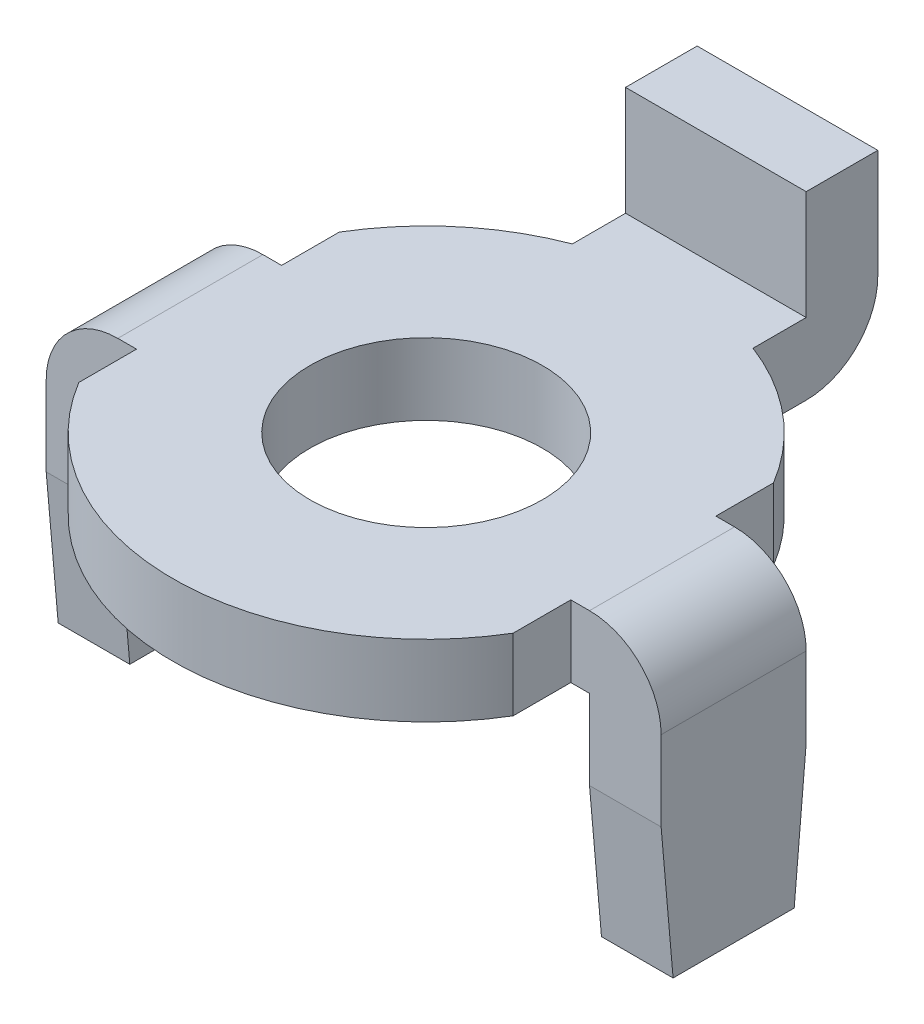
ISO-10303-21;
HEADER;
FILE_DESCRIPTION(('STEP AP214'),'2;1');
FILE_NAME('part.step','',(''),(''),'','','');
FILE_SCHEMA(('AUTOMOTIVE_DESIGN { 1 0 10303 214 1 1 1 1 }'));
ENDSEC;
DATA;
#1=APPLICATION_CONTEXT('core data for automotive mechanical design processes');
#2=APPLICATION_PROTOCOL_DEFINITION('international standard','automotive_design',2000,#1);
#3=PRODUCT_CONTEXT('',#1,'mechanical');
#4=PRODUCT('Part','Part','',(#3));
#5=PRODUCT_RELATED_PRODUCT_CATEGORY('part','',(#4));
#6=PRODUCT_DEFINITION_FORMATION('','',#4);
#7=PRODUCT_DEFINITION_CONTEXT('part definition',#1,'design');
#8=PRODUCT_DEFINITION('design','',#6,#7);
#9=PRODUCT_DEFINITION_SHAPE('','',#8);
#10=(LENGTH_UNIT() NAMED_UNIT(*) SI_UNIT(.MILLI.,.METRE.));
#11=(NAMED_UNIT(*) PLANE_ANGLE_UNIT() SI_UNIT($,.RADIAN.));
#12=(NAMED_UNIT(*) SI_UNIT($,.STERADIAN.) SOLID_ANGLE_UNIT());
#13=UNCERTAINTY_MEASURE_WITH_UNIT(LENGTH_MEASURE(1.E-05),#10,'distance_accuracy_value','');
#14=(GEOMETRIC_REPRESENTATION_CONTEXT(3) GLOBAL_UNCERTAINTY_ASSIGNED_CONTEXT((#13)) GLOBAL_UNIT_ASSIGNED_CONTEXT((#10,
#11,#12)) REPRESENTATION_CONTEXT('',''));
#15=CARTESIAN_POINT('',(0.,0.,0.));
#16=DIRECTION('',(0.,0.,1.));
#17=DIRECTION('',(1.,0.,0.));
#18=AXIS2_PLACEMENT_3D('',#15,#16,#17);
#19=CARTESIAN_POINT('',(0.,0.,0.));
#20=DIRECTION('',(0.,1.,0.));
#21=DIRECTION('',(0.,0.,1.));
#22=AXIS2_PLACEMENT_3D('',#19,#20,#21);
#23=PLANE('',#22);
#24=CARTESIAN_POINT('',(0.,0.,0.));
#25=DIRECTION('',(0.,1.,0.));
#26=DIRECTION('',(0.,0.,1.));
#27=AXIS2_PLACEMENT_3D('',#24,#25,#26);
#28=CIRCLE('',#27,2.55);
#29=CARTESIAN_POINT('',(0.,0.,2.55));
#30=VERTEX_POINT('',#29);
#31=EDGE_CURVE('E554',#30,#30,#28,.T.);
#32=ORIENTED_EDGE('',*,*,#31,.T.);
#33=EDGE_LOOP('',(#32));
#34=FACE_BOUND('',#33,.T.);
#35=DIRECTION('',(0.,0.,1.));
#36=VECTOR('',#35,1.);
#37=CARTESIAN_POINT('',(-1.98,0.,-7.92));
#38=LINE('',#37,#36);
#39=CARTESIAN_POINT('',(-1.98,0.,-6.35));
#40=VERTEX_POINT('',#39);
#41=CARTESIAN_POINT('',(-1.98,0.,-5.18479507791774));
#42=VERTEX_POINT('',#41);
#43=EDGE_CURVE('E433',#40,#42,#38,.T.);
#44=ORIENTED_EDGE('',*,*,#43,.F.);
#45=DIRECTION('',(-1.,0.,0.));
#46=VECTOR('',#45,1.);
#47=CARTESIAN_POINT('',(0.,0.,-6.35));
#48=LINE('',#47,#46);
#49=CARTESIAN_POINT('',(1.98,0.,-6.35));
#50=VERTEX_POINT('',#49);
#51=EDGE_CURVE('E310',#40,#50,#48,.F.);
#52=ORIENTED_EDGE('',*,*,#51,.T.);
#53=DIRECTION('',(0.,0.,-1.));
#54=VECTOR('',#53,1.);
#55=CARTESIAN_POINT('',(1.98,0.,-7.92));
#56=LINE('',#55,#54);
#57=CARTESIAN_POINT('',(1.98,0.,-5.18479507791774));
#58=VERTEX_POINT('',#57);
#59=EDGE_CURVE('E429',#58,#50,#56,.T.);
#60=ORIENTED_EDGE('',*,*,#59,.F.);
#61=CARTESIAN_POINT('',(0.,0.,0.));
#62=DIRECTION('',(0.,1.,0.));
#63=DIRECTION('',(0.,0.,1.));
#64=AXIS2_PLACEMENT_3D('',#61,#62,#63);
#65=CIRCLE('',#64,5.55);
#66=CARTESIAN_POINT('',(4.76,0.,-2.85392711890125));
#67=VERTEX_POINT('',#66);
#68=EDGE_CURVE('E426',#67,#58,#65,.T.);
#69=ORIENTED_EDGE('',*,*,#68,.F.);
#70=DIRECTION('',(0.,0.,-1.));
#71=VECTOR('',#70,1.);
#72=CARTESIAN_POINT('',(4.76,0.,-2.85392711890125));
#73=LINE('',#72,#71);
#74=CARTESIAN_POINT('',(4.76,0.,-1.59));
#75=VERTEX_POINT('',#74);
#76=EDGE_CURVE('E424',#75,#67,#73,.T.);
#77=ORIENTED_EDGE('',*,*,#76,.F.);
#78=DIRECTION('',(-1.,0.,0.));
#79=VECTOR('',#78,1.);
#80=CARTESIAN_POINT('',(4.76,0.,-1.59));
#81=LINE('',#80,#79);
#82=CARTESIAN_POINT('',(5.17,0.,-1.59));
#83=VERTEX_POINT('',#82);
#84=EDGE_CURVE('E421',#83,#75,#81,.T.);
#85=ORIENTED_EDGE('',*,*,#84,.F.);
#86=DIRECTION('',(0.,0.,-1.));
#87=VECTOR('',#86,1.);
#88=CARTESIAN_POINT('',(5.17,0.,1.59));
#89=LINE('',#88,#87);
#90=CARTESIAN_POINT('',(5.17,0.,1.59));
#91=VERTEX_POINT('',#90);
#92=EDGE_CURVE('E261',#91,#83,#89,.T.);
#93=ORIENTED_EDGE('',*,*,#92,.F.);
#94=DIRECTION('',(1.,0.,0.));
#95=VECTOR('',#94,1.);
#96=CARTESIAN_POINT('',(6.74,0.,1.59));
#97=LINE('',#96,#95);
#98=CARTESIAN_POINT('',(4.76,0.,1.59));
#99=VERTEX_POINT('',#98);
#100=EDGE_CURVE('E417',#99,#91,#97,.T.);
#101=ORIENTED_EDGE('',*,*,#100,.F.);
#102=DIRECTION('',(0.,0.,-1.));
#103=VECTOR('',#102,1.);
#104=CARTESIAN_POINT('',(4.76,0.,1.59));
#105=LINE('',#104,#103);
#106=CARTESIAN_POINT('',(4.76,0.,2.85392711890125));
#107=VERTEX_POINT('',#106);
#108=EDGE_CURVE('E412',#107,#99,#105,.T.);
#109=ORIENTED_EDGE('',*,*,#108,.F.);
#110=CARTESIAN_POINT('',(0.,0.,0.));
#111=DIRECTION('',(0.,1.,0.));
#112=DIRECTION('',(0.,0.,1.));
#113=AXIS2_PLACEMENT_3D('',#110,#111,#112);
#114=CIRCLE('',#113,5.55);
#115=CARTESIAN_POINT('',(-4.76,0.,2.85392711890125));
#116=VERTEX_POINT('',#115);
#117=EDGE_CURVE('E405',#116,#107,#114,.T.);
#118=ORIENTED_EDGE('',*,*,#117,.F.);
#119=DIRECTION('',(0.,0.,1.));
#120=VECTOR('',#119,1.);
#121=CARTESIAN_POINT('',(-4.76,0.,1.59));
#122=LINE('',#121,#120);
#123=CARTESIAN_POINT('',(-4.76,0.,1.59));
#124=VERTEX_POINT('',#123);
#125=EDGE_CURVE('E398',#124,#116,#122,.T.);
#126=ORIENTED_EDGE('',*,*,#125,.F.);
#127=DIRECTION('',(1.,0.,0.));
#128=VECTOR('',#127,1.);
#129=CARTESIAN_POINT('',(-6.74,0.,1.59));
#130=LINE('',#129,#128);
#131=CARTESIAN_POINT('',(-5.17,0.,1.59));
#132=VERTEX_POINT('',#131);
#133=EDGE_CURVE('E394',#132,#124,#130,.T.);
#134=ORIENTED_EDGE('',*,*,#133,.F.);
#135=DIRECTION('',(0.,0.,1.));
#136=VECTOR('',#135,1.);
#137=CARTESIAN_POINT('',(-5.17,0.,1.59));
#138=LINE('',#137,#136);
#139=CARTESIAN_POINT('',(-5.17,0.,-1.59));
#140=VERTEX_POINT('',#139);
#141=EDGE_CURVE('E361',#140,#132,#138,.T.);
#142=ORIENTED_EDGE('',*,*,#141,.F.);
#143=DIRECTION('',(-1.,0.,0.));
#144=VECTOR('',#143,1.);
#145=CARTESIAN_POINT('',(-4.76,0.,-1.59));
#146=LINE('',#145,#144);
#147=CARTESIAN_POINT('',(-4.76,0.,-1.59));
#148=VERTEX_POINT('',#147);
#149=EDGE_CURVE('E390',#148,#140,#146,.T.);
#150=ORIENTED_EDGE('',*,*,#149,.F.);
#151=DIRECTION('',(0.,0.,1.));
#152=VECTOR('',#151,1.);
#153=CARTESIAN_POINT('',(-4.76,0.,-2.85392711890125));
#154=LINE('',#153,#152);
#155=CARTESIAN_POINT('',(-4.76,0.,-2.85392711890125));
#156=VERTEX_POINT('',#155);
#157=EDGE_CURVE('E439',#156,#148,#154,.T.);
#158=ORIENTED_EDGE('',*,*,#157,.F.);
#159=CARTESIAN_POINT('',(0.,0.,0.));
#160=DIRECTION('',(0.,1.,0.));
#161=DIRECTION('',(0.,0.,1.));
#162=AXIS2_PLACEMENT_3D('',#159,#160,#161);
#163=CIRCLE('',#162,5.55);
#164=EDGE_CURVE('E436',#42,#156,#163,.T.);
#165=ORIENTED_EDGE('',*,*,#164,.F.);
#166=EDGE_LOOP('',(#44,#52,#60,#69,#77,#85,#93,#101,#109,#118,#126,#134,#142,#150,#158,#165));
#167=FACE_BOUND('',#166,.T.);
#168=ADVANCED_FACE('F37',(#34,#167),#23,.F.);
#169=CARTESIAN_POINT('',(0.,1.57,0.));
#170=DIRECTION('',(0.,1.,0.));
#171=DIRECTION('',(0.,0.,1.));
#172=AXIS2_PLACEMENT_3D('',#169,#170,#171);
#173=PLANE('',#172);
#174=DIRECTION('',(-1.,0.,0.));
#175=VECTOR('',#174,1.);
#176=CARTESIAN_POINT('',(-4.76,1.57,-1.59));
#177=LINE('',#176,#175);
#178=CARTESIAN_POINT('',(-4.76,1.57,-1.59));
#179=VERTEX_POINT('',#178);
#180=CARTESIAN_POINT('',(-5.17,1.57,-1.59));
#181=VERTEX_POINT('',#180);
#182=EDGE_CURVE('E442',#179,#181,#177,.T.);
#183=ORIENTED_EDGE('',*,*,#182,.T.);
#184=DIRECTION('',(0.,0.,1.));
#185=VECTOR('',#184,1.);
#186=CARTESIAN_POINT('',(-5.17,1.57,1.59));
#187=LINE('',#186,#185);
#188=CARTESIAN_POINT('',(-5.17,1.57,1.59));
#189=VERTEX_POINT('',#188);
#190=EDGE_CURVE('E280',#181,#189,#187,.T.);
#191=ORIENTED_EDGE('',*,*,#190,.T.);
#192=DIRECTION('',(1.,0.,0.));
#193=VECTOR('',#192,1.);
#194=CARTESIAN_POINT('',(-6.74,1.57,1.59));
#195=LINE('',#194,#193);
#196=CARTESIAN_POINT('',(-4.76,1.57,1.59));
#197=VERTEX_POINT('',#196);
#198=EDGE_CURVE('E561',#189,#197,#195,.T.);
#199=ORIENTED_EDGE('',*,*,#198,.T.);
#200=DIRECTION('',(0.,0.,1.));
#201=VECTOR('',#200,1.);
#202=CARTESIAN_POINT('',(-4.76,1.57,1.59));
#203=LINE('',#202,#201);
#204=CARTESIAN_POINT('',(-4.76,1.57,2.85392711890125));
#205=VERTEX_POINT('',#204);
#206=EDGE_CURVE('E564',#197,#205,#203,.T.);
#207=ORIENTED_EDGE('',*,*,#206,.T.);
#208=CARTESIAN_POINT('',(0.,1.57,0.));
#209=DIRECTION('',(0.,1.,0.));
#210=DIRECTION('',(0.,0.,1.));
#211=AXIS2_PLACEMENT_3D('',#208,#209,#210);
#212=CIRCLE('',#211,5.55);
#213=CARTESIAN_POINT('',(4.76,1.57,2.85392711890125));
#214=VERTEX_POINT('',#213);
#215=EDGE_CURVE('E567',#205,#214,#212,.T.);
#216=ORIENTED_EDGE('',*,*,#215,.T.);
#217=DIRECTION('',(0.,0.,-1.));
#218=VECTOR('',#217,1.);
#219=CARTESIAN_POINT('',(4.76,1.57,1.59));
#220=LINE('',#219,#218);
#221=CARTESIAN_POINT('',(4.76,1.57,1.59));
#222=VERTEX_POINT('',#221);
#223=EDGE_CURVE('E570',#214,#222,#220,.T.);
#224=ORIENTED_EDGE('',*,*,#223,.T.);
#225=DIRECTION('',(1.,0.,0.));
#226=VECTOR('',#225,1.);
#227=CARTESIAN_POINT('',(6.74,1.57,1.59));
#228=LINE('',#227,#226);
#229=CARTESIAN_POINT('',(5.17,1.57,1.59));
#230=VERTEX_POINT('',#229);
#231=EDGE_CURVE('E573',#222,#230,#228,.T.);
#232=ORIENTED_EDGE('',*,*,#231,.T.);
#233=DIRECTION('',(0.,0.,-1.));
#234=VECTOR('',#233,1.);
#235=CARTESIAN_POINT('',(5.17,1.57,-1.59));
#236=LINE('',#235,#234);
#237=CARTESIAN_POINT('',(5.17,1.57,-1.59));
#238=VERTEX_POINT('',#237);
#239=EDGE_CURVE('E276',#230,#238,#236,.T.);
#240=ORIENTED_EDGE('',*,*,#239,.T.);
#241=DIRECTION('',(-1.,0.,0.));
#242=VECTOR('',#241,1.);
#243=CARTESIAN_POINT('',(4.76,1.57,-1.59));
#244=LINE('',#243,#242);
#245=CARTESIAN_POINT('',(4.76,1.57,-1.59));
#246=VERTEX_POINT('',#245);
#247=EDGE_CURVE('E576',#238,#246,#244,.T.);
#248=ORIENTED_EDGE('',*,*,#247,.T.);
#249=DIRECTION('',(0.,0.,-1.));
#250=VECTOR('',#249,1.);
#251=CARTESIAN_POINT('',(4.76,1.57,-2.85392711890125));
#252=LINE('',#251,#250);
#253=CARTESIAN_POINT('',(4.76,1.57,-2.85392711890125));
#254=VERTEX_POINT('',#253);
#255=EDGE_CURVE('E578',#246,#254,#252,.T.);
#256=ORIENTED_EDGE('',*,*,#255,.T.);
#257=CARTESIAN_POINT('',(0.,1.57,0.));
#258=DIRECTION('',(0.,1.,0.));
#259=DIRECTION('',(0.,0.,1.));
#260=AXIS2_PLACEMENT_3D('',#257,#258,#259);
#261=CIRCLE('',#260,5.55);
#262=CARTESIAN_POINT('',(1.98,1.57,-5.18479507791774));
#263=VERTEX_POINT('',#262);
#264=EDGE_CURVE('E370',#254,#263,#261,.T.);
#265=ORIENTED_EDGE('',*,*,#264,.T.);
#266=DIRECTION('',(0.,0.,-1.));
#267=VECTOR('',#266,1.);
#268=CARTESIAN_POINT('',(1.98,1.57,-7.92));
#269=LINE('',#268,#267);
#270=CARTESIAN_POINT('',(1.98,1.57,-6.35));
#271=VERTEX_POINT('',#270);
#272=EDGE_CURVE('E366',#263,#271,#269,.T.);
#273=ORIENTED_EDGE('',*,*,#272,.T.);
#274=DIRECTION('',(1.,0.,0.));
#275=VECTOR('',#274,1.);
#276=CARTESIAN_POINT('',(-1.98,1.57,-6.35));
#277=LINE('',#276,#275);
#278=CARTESIAN_POINT('',(-1.98,1.57,-6.35));
#279=VERTEX_POINT('',#278);
#280=EDGE_CURVE('E254',#279,#271,#277,.T.);
#281=ORIENTED_EDGE('',*,*,#280,.F.);
#282=DIRECTION('',(0.,0.,1.));
#283=VECTOR('',#282,1.);
#284=CARTESIAN_POINT('',(-1.98,1.57,-7.92));
#285=LINE('',#284,#283);
#286=CARTESIAN_POINT('',(-1.98,1.57,-5.18479507791774));
#287=VERTEX_POINT('',#286);
#288=EDGE_CURVE('E259',#279,#287,#285,.T.);
#289=ORIENTED_EDGE('',*,*,#288,.T.);
#290=CARTESIAN_POINT('',(0.,1.57,0.));
#291=DIRECTION('',(0.,1.,0.));
#292=DIRECTION('',(0.,0.,1.));
#293=AXIS2_PLACEMENT_3D('',#290,#291,#292);
#294=CIRCLE('',#293,5.55);
#295=CARTESIAN_POINT('',(-4.76,1.57,-2.85392711890125));
#296=VERTEX_POINT('',#295);
#297=EDGE_CURVE('E378',#287,#296,#294,.T.);
#298=ORIENTED_EDGE('',*,*,#297,.T.);
#299=DIRECTION('',(0.,0.,1.));
#300=VECTOR('',#299,1.);
#301=CARTESIAN_POINT('',(-4.76,1.57,-2.85392711890125));
#302=LINE('',#301,#300);
#303=EDGE_CURVE('E381',#296,#179,#302,.T.);
#304=ORIENTED_EDGE('',*,*,#303,.T.);
#305=EDGE_LOOP('',(#183,#191,#199,#207,#216,#224,#232,#240,#248,#256,#265,#273,#281,#289,#298,#304));
#306=FACE_BOUND('',#305,.T.);
#307=CARTESIAN_POINT('',(0.,1.57,0.));
#308=DIRECTION('',(0.,1.,0.));
#309=DIRECTION('',(0.,0.,1.));
#310=AXIS2_PLACEMENT_3D('',#307,#308,#309);
#311=CIRCLE('',#310,2.55);
#312=CARTESIAN_POINT('',(0.,1.57,2.55));
#313=VERTEX_POINT('',#312);
#314=EDGE_CURVE('E395',#313,#313,#311,.T.);
#315=ORIENTED_EDGE('',*,*,#314,.F.);
#316=EDGE_LOOP('',(#315));
#317=FACE_BOUND('',#316,.T.);
#318=ADVANCED_FACE('F584',(#306,#317),#173,.T.);
#319=CARTESIAN_POINT('',(-4.76,1.57,-1.59));
#320=DIRECTION('',(0.,0.,1.));
#321=DIRECTION('',(1.,0.,0.));
#322=AXIS2_PLACEMENT_3D('',#319,#320,#321);
#323=PLANE('',#322);
#324=DIRECTION('',(0.,1.,0.));
#325=VECTOR('',#324,1.);
#326=CARTESIAN_POINT('',(-5.17,-4.75,-1.59));
#327=LINE('',#326,#325);
#328=CARTESIAN_POINT('',(-5.17,-1.74999999999988,-1.59));
#329=VERTEX_POINT('',#328);
#330=EDGE_CURVE('E355',#329,#140,#327,.T.);
#331=ORIENTED_EDGE('',*,*,#330,.F.);
#332=DIRECTION('',(-1.,0.,0.));
#333=VECTOR('',#332,1.);
#334=CARTESIAN_POINT('',(-6.74,-1.74999999999988,-1.59));
#335=LINE('',#334,#333);
#336=CARTESIAN_POINT('',(-6.74,-1.74999999999971,-1.59000000000001));
#337=VERTEX_POINT('',#336);
#338=EDGE_CURVE('E61',#329,#337,#335,.T.);
#339=ORIENTED_EDGE('',*,*,#338,.T.);
#340=DIRECTION('',(0.,-1.,0.));
#341=VECTOR('',#340,1.);
#342=CARTESIAN_POINT('',(-6.74,1.57,-1.59));
#343=LINE('',#342,#341);
#344=CARTESIAN_POINT('',(-6.74,0.,-1.59));
#345=VERTEX_POINT('',#344);
#346=EDGE_CURVE('E281',#345,#337,#343,.T.);
#347=ORIENTED_EDGE('',*,*,#346,.F.);
#348=CARTESIAN_POINT('',(-5.17,0.,-1.59));
#349=DIRECTION('',(0.,0.,1.));
#350=DIRECTION('',(1.,0.,0.));
#351=AXIS2_PLACEMENT_3D('',#348,#349,#350);
#352=CIRCLE('',#351,1.57);
#353=EDGE_CURVE('E291',#345,#181,#352,.F.);
#354=ORIENTED_EDGE('',*,*,#353,.T.);
#355=ORIENTED_EDGE('',*,*,#182,.F.);
#356=DIRECTION('',(0.,-1.,0.));
#357=VECTOR('',#356,1.);
#358=CARTESIAN_POINT('',(-4.76,1.57,-1.59));
#359=LINE('',#358,#357);
#360=EDGE_CURVE('E384',#179,#148,#359,.T.);
#361=ORIENTED_EDGE('',*,*,#360,.T.);
#362=ORIENTED_EDGE('',*,*,#149,.T.);
#363=EDGE_LOOP('',(#331,#339,#347,#354,#355,#361,#362));
#364=FACE_BOUND('',#363,.T.);
#365=ADVANCED_FACE('F670',(#364),#323,.F.);
#366=CARTESIAN_POINT('',(-6.74,1.57,-1.59));
#367=DIRECTION('',(1.,0.,0.));
#368=DIRECTION('',(0.,0.,-1.));
#369=AXIS2_PLACEMENT_3D('',#366,#367,#368);
#370=PLANE('',#369);
#371=ORIENTED_EDGE('',*,*,#346,.T.);
#372=DIRECTION('',(0.,-0.996194698091746,0.0871557427476549));
#373=VECTOR('',#372,1.);
#374=CARTESIAN_POINT('',(-6.74,-4.75,-1.32753400942223));
#375=LINE('',#374,#373);
#376=CARTESIAN_POINT('',(-6.74,-4.75,-1.32753400942223));
#377=VERTEX_POINT('',#376);
#378=EDGE_CURVE('E46',#337,#377,#375,.T.);
#379=ORIENTED_EDGE('',*,*,#378,.T.);
#380=DIRECTION('',(0.,0.,-1.));
#381=VECTOR('',#380,1.);
#382=CARTESIAN_POINT('',(-6.74,-4.75,1.59));
#383=LINE('',#382,#381);
#384=CARTESIAN_POINT('',(-6.74,-4.75,1.32753400942223));
#385=VERTEX_POINT('',#384);
#386=EDGE_CURVE('E526',#385,#377,#383,.T.);
#387=ORIENTED_EDGE('',*,*,#386,.F.);
#388=DIRECTION('',(0.,0.996194698091746,0.0871557427476548));
#389=VECTOR('',#388,1.);
#390=CARTESIAN_POINT('',(-6.74,-4.75,1.32753400942223));
#391=LINE('',#390,#389);
#392=CARTESIAN_POINT('',(-6.74,-1.74999999999987,1.59));
#393=VERTEX_POINT('',#392);
#394=EDGE_CURVE('E53',#385,#393,#391,.T.);
#395=ORIENTED_EDGE('',*,*,#394,.T.);
#396=DIRECTION('',(0.,-1.,0.));
#397=VECTOR('',#396,1.);
#398=CARTESIAN_POINT('',(-6.74,1.57,1.59));
#399=LINE('',#398,#397);
#400=CARTESIAN_POINT('',(-6.74,0.,1.59));
#401=VERTEX_POINT('',#400);
#402=EDGE_CURVE('E492',#401,#393,#399,.T.);
#403=ORIENTED_EDGE('',*,*,#402,.F.);
#404=DIRECTION('',(0.,0.,1.));
#405=VECTOR('',#404,1.);
#406=CARTESIAN_POINT('',(-6.74,0.,-1.59));
#407=LINE('',#406,#405);
#408=EDGE_CURVE('E288',#401,#345,#407,.F.);
#409=ORIENTED_EDGE('',*,*,#408,.T.);
#410=EDGE_LOOP('',(#371,#379,#387,#395,#403,#409));
#411=FACE_BOUND('',#410,.T.);
#412=ADVANCED_FACE('F498',(#411),#370,.F.);
#413=CARTESIAN_POINT('',(-6.74,1.57,1.59));
#414=DIRECTION('',(0.,0.,-1.));
#415=DIRECTION('',(-1.,0.,0.));
#416=AXIS2_PLACEMENT_3D('',#413,#414,#415);
#417=PLANE('',#416);
#418=ORIENTED_EDGE('',*,*,#402,.T.);
#419=DIRECTION('',(1.,0.,0.));
#420=VECTOR('',#419,1.);
#421=CARTESIAN_POINT('',(-5.17,-1.74999999999987,1.59));
#422=LINE('',#421,#420);
#423=CARTESIAN_POINT('',(-5.17,-1.74999999999988,1.59));
#424=VERTEX_POINT('',#423);
#425=EDGE_CURVE('E11',#393,#424,#422,.T.);
#426=ORIENTED_EDGE('',*,*,#425,.T.);
#427=DIRECTION('',(0.,1.,0.));
#428=VECTOR('',#427,1.);
#429=CARTESIAN_POINT('',(-5.17,-4.75,1.59));
#430=LINE('',#429,#428);
#431=EDGE_CURVE('E351',#424,#132,#430,.T.);
#432=ORIENTED_EDGE('',*,*,#431,.T.);
#433=ORIENTED_EDGE('',*,*,#133,.T.);
#434=DIRECTION('',(0.,-1.,0.));
#435=VECTOR('',#434,1.);
#436=CARTESIAN_POINT('',(-4.76,1.57,1.59));
#437=LINE('',#436,#435);
#438=EDGE_CURVE('E490',#197,#124,#437,.T.);
#439=ORIENTED_EDGE('',*,*,#438,.F.);
#440=ORIENTED_EDGE('',*,*,#198,.F.);
#441=CARTESIAN_POINT('',(-5.17,0.,1.59));
#442=DIRECTION('',(0.,0.,-1.));
#443=DIRECTION('',(-1.,0.,0.));
#444=AXIS2_PLACEMENT_3D('',#441,#442,#443);
#445=CIRCLE('',#444,1.57);
#446=EDGE_CURVE('E285',#189,#401,#445,.F.);
#447=ORIENTED_EDGE('',*,*,#446,.T.);
#448=EDGE_LOOP('',(#418,#426,#432,#433,#439,#440,#447));
#449=FACE_BOUND('',#448,.T.);
#450=ADVANCED_FACE('F528',(#449),#417,.F.);
#451=CARTESIAN_POINT('',(-4.76,1.57,1.59));
#452=DIRECTION('',(1.,0.,0.));
#453=DIRECTION('',(0.,0.,-1.));
#454=AXIS2_PLACEMENT_3D('',#451,#452,#453);
#455=PLANE('',#454);
#456=ORIENTED_EDGE('',*,*,#125,.T.);
#457=DIRECTION('',(0.,-1.,0.));
#458=VECTOR('',#457,1.);
#459=CARTESIAN_POINT('',(-4.76,1.57,2.85392711890125));
#460=LINE('',#459,#458);
#461=EDGE_CURVE('E487',#205,#116,#460,.T.);
#462=ORIENTED_EDGE('',*,*,#461,.F.);
#463=ORIENTED_EDGE('',*,*,#206,.F.);
#464=ORIENTED_EDGE('',*,*,#438,.T.);
#465=EDGE_LOOP('',(#456,#462,#463,#464));
#466=FACE_BOUND('',#465,.T.);
#467=ADVANCED_FACE('F620',(#466),#455,.F.);
#468=CARTESIAN_POINT('',(0.,1.57,0.));
#469=DIRECTION('',(0.,-1.,0.));
#470=DIRECTION('',(0.,0.,-1.));
#471=AXIS2_PLACEMENT_3D('',#468,#469,#470);
#472=CYLINDRICAL_SURFACE('',#471,5.55);
#473=ORIENTED_EDGE('',*,*,#117,.T.);
#474=DIRECTION('',(0.,-1.,0.));
#475=VECTOR('',#474,1.);
#476=CARTESIAN_POINT('',(4.76,1.57,2.85392711890125));
#477=LINE('',#476,#475);
#478=EDGE_CURVE('E484',#214,#107,#477,.T.);
#479=ORIENTED_EDGE('',*,*,#478,.F.);
#480=ORIENTED_EDGE('',*,*,#215,.F.);
#481=ORIENTED_EDGE('',*,*,#461,.T.);
#482=EDGE_LOOP('',(#473,#479,#480,#481));
#483=FACE_BOUND('',#482,.T.);
#484=ADVANCED_FACE('F622',(#483),#472,.T.);
#485=CARTESIAN_POINT('',(4.76,1.57,1.59));
#486=DIRECTION('',(-1.,0.,0.));
#487=DIRECTION('',(0.,0.,1.));
#488=AXIS2_PLACEMENT_3D('',#485,#486,#487);
#489=PLANE('',#488);
#490=ORIENTED_EDGE('',*,*,#108,.T.);
#491=DIRECTION('',(0.,-1.,0.));
#492=VECTOR('',#491,1.);
#493=CARTESIAN_POINT('',(4.76,1.57,1.59));
#494=LINE('',#493,#492);
#495=EDGE_CURVE('E480',#222,#99,#494,.T.);
#496=ORIENTED_EDGE('',*,*,#495,.F.);
#497=ORIENTED_EDGE('',*,*,#223,.F.);
#498=ORIENTED_EDGE('',*,*,#478,.T.);
#499=EDGE_LOOP('',(#490,#496,#497,#498));
#500=FACE_BOUND('',#499,.T.);
#501=ADVANCED_FACE('F627',(#500),#489,.F.);
#502=CARTESIAN_POINT('',(6.74,1.57,1.59));
#503=DIRECTION('',(0.,0.,-1.));
#504=DIRECTION('',(-1.,0.,0.));
#505=AXIS2_PLACEMENT_3D('',#502,#503,#504);
#506=PLANE('',#505);
#507=DIRECTION('',(0.,1.,0.));
#508=VECTOR('',#507,1.);
#509=CARTESIAN_POINT('',(5.17,-4.75,1.59));
#510=LINE('',#509,#508);
#511=CARTESIAN_POINT('',(5.17,-1.74999999999986,1.59));
#512=VERTEX_POINT('',#511);
#513=EDGE_CURVE('E535',#512,#91,#510,.T.);
#514=ORIENTED_EDGE('',*,*,#513,.F.);
#515=DIRECTION('',(1.,0.,0.));
#516=VECTOR('',#515,1.);
#517=CARTESIAN_POINT('',(6.74,-1.74999999999986,1.59));
#518=LINE('',#517,#516);
#519=CARTESIAN_POINT('',(6.74,-1.74999999999949,1.59000000000002));
#520=VERTEX_POINT('',#519);
#521=EDGE_CURVE('E339',#512,#520,#518,.T.);
#522=ORIENTED_EDGE('',*,*,#521,.T.);
#523=DIRECTION('',(0.,-1.,0.));
#524=VECTOR('',#523,1.);
#525=CARTESIAN_POINT('',(6.74,1.57,1.59));
#526=LINE('',#525,#524);
#527=CARTESIAN_POINT('',(6.74,0.,1.59));
#528=VERTEX_POINT('',#527);
#529=EDGE_CURVE('E476',#528,#520,#526,.T.);
#530=ORIENTED_EDGE('',*,*,#529,.F.);
#531=CARTESIAN_POINT('',(5.17,0.,1.59));
#532=DIRECTION('',(0.,0.,-1.));
#533=DIRECTION('',(-1.,0.,0.));
#534=AXIS2_PLACEMENT_3D('',#531,#532,#533);
#535=CIRCLE('',#534,1.57);
#536=EDGE_CURVE('E300',#528,#230,#535,.F.);
#537=ORIENTED_EDGE('',*,*,#536,.T.);
#538=ORIENTED_EDGE('',*,*,#231,.F.);
#539=ORIENTED_EDGE('',*,*,#495,.T.);
#540=ORIENTED_EDGE('',*,*,#100,.T.);
#541=EDGE_LOOP('',(#514,#522,#530,#537,#538,#539,#540));
#542=FACE_BOUND('',#541,.T.);
#543=ADVANCED_FACE('F707',(#542),#506,.F.);
#544=CARTESIAN_POINT('',(6.74,1.57,-1.59));
#545=DIRECTION('',(-1.,0.,0.));
#546=DIRECTION('',(0.,0.,1.));
#547=AXIS2_PLACEMENT_3D('',#544,#545,#546);
#548=PLANE('',#547);
#549=DIRECTION('',(0.,0.,1.));
#550=VECTOR('',#549,1.);
#551=CARTESIAN_POINT('',(6.74,-4.75,1.59));
#552=LINE('',#551,#550);
#553=CARTESIAN_POINT('',(6.74,-4.75,-1.32753400942223));
#554=VERTEX_POINT('',#553);
#555=CARTESIAN_POINT('',(6.74,-4.75,1.32753400942223));
#556=VERTEX_POINT('',#555);
#557=EDGE_CURVE('E267',#554,#556,#552,.T.);
#558=ORIENTED_EDGE('',*,*,#557,.F.);
#559=DIRECTION('',(0.,-0.996194698091746,0.0871557427476549));
#560=VECTOR('',#559,1.);
#561=CARTESIAN_POINT('',(6.74,-4.75,-1.32753400942223));
#562=LINE('',#561,#560);
#563=CARTESIAN_POINT('',(6.74,-1.74999999999988,-1.59));
#564=VERTEX_POINT('',#563);
#565=EDGE_CURVE('E327',#554,#564,#562,.F.);
#566=ORIENTED_EDGE('',*,*,#565,.T.);
#567=DIRECTION('',(0.,-1.,0.));
#568=VECTOR('',#567,1.);
#569=CARTESIAN_POINT('',(6.74,1.57,-1.59));
#570=LINE('',#569,#568);
#571=CARTESIAN_POINT('',(6.74,0.,-1.59));
#572=VERTEX_POINT('',#571);
#573=EDGE_CURVE('E472',#572,#564,#570,.T.);
#574=ORIENTED_EDGE('',*,*,#573,.F.);
#575=DIRECTION('',(0.,0.,-1.));
#576=VECTOR('',#575,1.);
#577=CARTESIAN_POINT('',(6.74,0.,1.59));
#578=LINE('',#577,#576);
#579=EDGE_CURVE('E297',#572,#528,#578,.F.);
#580=ORIENTED_EDGE('',*,*,#579,.T.);
#581=ORIENTED_EDGE('',*,*,#529,.T.);
#582=DIRECTION('',(0.,0.996194698091746,0.0871557427476548));
#583=VECTOR('',#582,1.);
#584=CARTESIAN_POINT('',(6.74,-4.75,1.32753400942223));
#585=LINE('',#584,#583);
#586=EDGE_CURVE('E324',#520,#556,#585,.F.);
#587=ORIENTED_EDGE('',*,*,#586,.T.);
#588=EDGE_LOOP('',(#558,#566,#574,#580,#581,#587));
#589=FACE_BOUND('',#588,.T.);
#590=ADVANCED_FACE('F643',(#589),#548,.F.);
#591=CARTESIAN_POINT('',(4.76,1.57,-1.59));
#592=DIRECTION('',(0.,0.,1.));
#593=DIRECTION('',(1.,0.,0.));
#594=AXIS2_PLACEMENT_3D('',#591,#592,#593);
#595=PLANE('',#594);
#596=ORIENTED_EDGE('',*,*,#573,.T.);
#597=DIRECTION('',(-1.,0.,0.));
#598=VECTOR('',#597,1.);
#599=CARTESIAN_POINT('',(4.76,-1.74999999999988,-1.59));
#600=LINE('',#599,#598);
#601=CARTESIAN_POINT('',(5.17,-1.74999999999987,-1.59));
#602=VERTEX_POINT('',#601);
#603=EDGE_CURVE('E330',#564,#602,#600,.T.);
#604=ORIENTED_EDGE('',*,*,#603,.T.);
#605=DIRECTION('',(0.,1.,0.));
#606=VECTOR('',#605,1.);
#607=CARTESIAN_POINT('',(5.17,-4.75,-1.59));
#608=LINE('',#607,#606);
#609=EDGE_CURVE('E540',#602,#83,#608,.T.);
#610=ORIENTED_EDGE('',*,*,#609,.T.);
#611=ORIENTED_EDGE('',*,*,#84,.T.);
#612=DIRECTION('',(0.,-1.,0.));
#613=VECTOR('',#612,1.);
#614=CARTESIAN_POINT('',(4.76,1.57,-1.59));
#615=LINE('',#614,#613);
#616=EDGE_CURVE('E468',#246,#75,#615,.T.);
#617=ORIENTED_EDGE('',*,*,#616,.F.);
#618=ORIENTED_EDGE('',*,*,#247,.F.);
#619=CARTESIAN_POINT('',(5.17,0.,-1.59));
#620=DIRECTION('',(0.,0.,1.));
#621=DIRECTION('',(1.,0.,0.));
#622=AXIS2_PLACEMENT_3D('',#619,#620,#621);
#623=CIRCLE('',#622,1.57);
#624=EDGE_CURVE('E294',#238,#572,#623,.F.);
#625=ORIENTED_EDGE('',*,*,#624,.T.);
#626=EDGE_LOOP('',(#596,#604,#610,#611,#617,#618,#625));
#627=FACE_BOUND('',#626,.T.);
#628=ADVANCED_FACE('F638',(#627),#595,.F.);
#629=CARTESIAN_POINT('',(4.76,1.57,-2.85392711890125));
#630=DIRECTION('',(-1.,0.,0.));
#631=DIRECTION('',(0.,0.,1.));
#632=AXIS2_PLACEMENT_3D('',#629,#630,#631);
#633=PLANE('',#632);
#634=ORIENTED_EDGE('',*,*,#76,.T.);
#635=DIRECTION('',(0.,-1.,0.));
#636=VECTOR('',#635,1.);
#637=CARTESIAN_POINT('',(4.76,1.57,-2.85392711890125));
#638=LINE('',#637,#636);
#639=EDGE_CURVE('E464',#254,#67,#638,.T.);
#640=ORIENTED_EDGE('',*,*,#639,.F.);
#641=ORIENTED_EDGE('',*,*,#255,.F.);
#642=ORIENTED_EDGE('',*,*,#616,.T.);
#643=EDGE_LOOP('',(#634,#640,#641,#642));
#644=FACE_BOUND('',#643,.T.);
#645=ADVANCED_FACE('F662',(#644),#633,.F.);
#646=CARTESIAN_POINT('',(0.,1.57,0.));
#647=DIRECTION('',(0.,-1.,0.));
#648=DIRECTION('',(0.,0.,-1.));
#649=AXIS2_PLACEMENT_3D('',#646,#647,#648);
#650=CYLINDRICAL_SURFACE('',#649,5.55);
#651=ORIENTED_EDGE('',*,*,#68,.T.);
#652=DIRECTION('',(0.,-1.,0.));
#653=VECTOR('',#652,1.);
#654=CARTESIAN_POINT('',(1.98,1.57,-5.18479507791774));
#655=LINE('',#654,#653);
#656=EDGE_CURVE('E460',#263,#58,#655,.T.);
#657=ORIENTED_EDGE('',*,*,#656,.F.);
#658=ORIENTED_EDGE('',*,*,#264,.F.);
#659=ORIENTED_EDGE('',*,*,#639,.T.);
#660=EDGE_LOOP('',(#651,#657,#658,#659));
#661=FACE_BOUND('',#660,.T.);
#662=ADVANCED_FACE('F588',(#661),#650,.T.);
#663=CARTESIAN_POINT('',(1.98,1.57,-7.92));
#664=DIRECTION('',(-1.,0.,0.));
#665=DIRECTION('',(0.,0.,1.));
#666=AXIS2_PLACEMENT_3D('',#663,#664,#665);
#667=PLANE('',#666);
#668=ORIENTED_EDGE('',*,*,#59,.T.);
#669=CARTESIAN_POINT('',(1.98,1.57,-6.35));
#670=DIRECTION('',(-1.,0.,0.));
#671=DIRECTION('',(0.,0.,1.));
#672=AXIS2_PLACEMENT_3D('',#669,#670,#671);
#673=CIRCLE('',#672,1.57);
#674=CARTESIAN_POINT('',(1.98,1.57,-7.92));
#675=VERTEX_POINT('',#674);
#676=EDGE_CURVE('E313',#50,#675,#673,.F.);
#677=ORIENTED_EDGE('',*,*,#676,.T.);
#678=DIRECTION('',(0.,-1.,0.));
#679=VECTOR('',#678,1.);
#680=CARTESIAN_POINT('',(1.98,1.57,-7.92));
#681=LINE('',#680,#679);
#682=CARTESIAN_POINT('',(1.98,3.96,-7.92));
#683=VERTEX_POINT('',#682);
#684=EDGE_CURVE('E456',#683,#675,#681,.T.);
#685=ORIENTED_EDGE('',*,*,#684,.F.);
#686=DIRECTION('',(0.,0.,-1.));
#687=VECTOR('',#686,1.);
#688=CARTESIAN_POINT('',(1.98,3.96,-7.92));
#689=LINE('',#688,#687);
#690=CARTESIAN_POINT('',(1.98,3.96,-6.35));
#691=VERTEX_POINT('',#690);
#692=EDGE_CURVE('E243',#691,#683,#689,.T.);
#693=ORIENTED_EDGE('',*,*,#692,.F.);
#694=DIRECTION('',(0.,-1.,0.));
#695=VECTOR('',#694,1.);
#696=CARTESIAN_POINT('',(1.98,3.96,-6.35));
#697=LINE('',#696,#695);
#698=EDGE_CURVE('E238',#691,#271,#697,.T.);
#699=ORIENTED_EDGE('',*,*,#698,.T.);
#700=ORIENTED_EDGE('',*,*,#272,.F.);
#701=ORIENTED_EDGE('',*,*,#656,.T.);
#702=EDGE_LOOP('',(#668,#677,#685,#693,#699,#700,#701));
#703=FACE_BOUND('',#702,.T.);
#704=ADVANCED_FACE('F592',(#703),#667,.F.);
#705=CARTESIAN_POINT('',(-1.98,1.57,-7.92));
#706=DIRECTION('',(0.,0.,1.));
#707=DIRECTION('',(1.,0.,0.));
#708=AXIS2_PLACEMENT_3D('',#705,#706,#707);
#709=PLANE('',#708);
#710=ORIENTED_EDGE('',*,*,#684,.T.);
#711=DIRECTION('',(-1.,0.,0.));
#712=VECTOR('',#711,1.);
#713=CARTESIAN_POINT('',(-1.98,1.57,-7.92));
#714=LINE('',#713,#712);
#715=CARTESIAN_POINT('',(-1.98,1.57,-7.92));
#716=VERTEX_POINT('',#715);
#717=EDGE_CURVE('E303',#675,#716,#714,.T.);
#718=ORIENTED_EDGE('',*,*,#717,.T.);
#719=DIRECTION('',(0.,-1.,0.));
#720=VECTOR('',#719,1.);
#721=CARTESIAN_POINT('',(-1.98,1.57,-7.92));
#722=LINE('',#721,#720);
#723=CARTESIAN_POINT('',(-1.98,3.96,-7.92));
#724=VERTEX_POINT('',#723);
#725=EDGE_CURVE('E453',#724,#716,#722,.T.);
#726=ORIENTED_EDGE('',*,*,#725,.F.);
#727=DIRECTION('',(-1.,0.,0.));
#728=VECTOR('',#727,1.);
#729=CARTESIAN_POINT('',(-1.98,3.96,-7.92));
#730=LINE('',#729,#728);
#731=EDGE_CURVE('E250',#683,#724,#730,.T.);
#732=ORIENTED_EDGE('',*,*,#731,.F.);
#733=EDGE_LOOP('',(#710,#718,#726,#732));
#734=FACE_BOUND('',#733,.T.);
#735=ADVANCED_FACE('F669',(#734),#709,.F.);
#736=CARTESIAN_POINT('',(-1.98,1.57,-7.92));
#737=DIRECTION('',(1.,0.,0.));
#738=DIRECTION('',(0.,0.,-1.));
#739=AXIS2_PLACEMENT_3D('',#736,#737,#738);
#740=PLANE('',#739);
#741=ORIENTED_EDGE('',*,*,#725,.T.);
#742=CARTESIAN_POINT('',(-1.98,1.57,-6.35));
#743=DIRECTION('',(1.,0.,0.));
#744=DIRECTION('',(0.,0.,-1.));
#745=AXIS2_PLACEMENT_3D('',#742,#743,#744);
#746=CIRCLE('',#745,1.57);
#747=EDGE_CURVE('E307',#716,#40,#746,.F.);
#748=ORIENTED_EDGE('',*,*,#747,.T.);
#749=ORIENTED_EDGE('',*,*,#43,.T.);
#750=DIRECTION('',(0.,-1.,0.));
#751=VECTOR('',#750,1.);
#752=CARTESIAN_POINT('',(-1.98,1.57,-5.18479507791774));
#753=LINE('',#752,#751);
#754=EDGE_CURVE('E450',#287,#42,#753,.T.);
#755=ORIENTED_EDGE('',*,*,#754,.F.);
#756=ORIENTED_EDGE('',*,*,#288,.F.);
#757=DIRECTION('',(0.,-1.,0.));
#758=VECTOR('',#757,1.);
#759=CARTESIAN_POINT('',(-1.98,3.96,-6.35));
#760=LINE('',#759,#758);
#761=CARTESIAN_POINT('',(-1.98,3.96,-6.35));
#762=VERTEX_POINT('',#761);
#763=EDGE_CURVE('E236',#762,#279,#760,.T.);
#764=ORIENTED_EDGE('',*,*,#763,.F.);
#765=DIRECTION('',(0.,0.,1.));
#766=VECTOR('',#765,1.);
#767=CARTESIAN_POINT('',(-1.98,3.96,-7.92));
#768=LINE('',#767,#766);
#769=EDGE_CURVE('E244',#724,#762,#768,.T.);
#770=ORIENTED_EDGE('',*,*,#769,.F.);
#771=EDGE_LOOP('',(#741,#748,#749,#755,#756,#764,#770));
#772=FACE_BOUND('',#771,.T.);
#773=ADVANCED_FACE('F257',(#772),#740,.F.);
#774=CARTESIAN_POINT('',(0.,1.57,0.));
#775=DIRECTION('',(0.,-1.,0.));
#776=DIRECTION('',(0.,0.,-1.));
#777=AXIS2_PLACEMENT_3D('',#774,#775,#776);
#778=CYLINDRICAL_SURFACE('',#777,5.55);
#779=ORIENTED_EDGE('',*,*,#164,.T.);
#780=DIRECTION('',(0.,-1.,0.));
#781=VECTOR('',#780,1.);
#782=CARTESIAN_POINT('',(-4.76,1.57,-2.85392711890125));
#783=LINE('',#782,#781);
#784=EDGE_CURVE('E446',#296,#156,#783,.T.);
#785=ORIENTED_EDGE('',*,*,#784,.F.);
#786=ORIENTED_EDGE('',*,*,#297,.F.);
#787=ORIENTED_EDGE('',*,*,#754,.T.);
#788=EDGE_LOOP('',(#779,#785,#786,#787));
#789=FACE_BOUND('',#788,.T.);
#790=ADVANCED_FACE('F606',(#789),#778,.T.);
#791=CARTESIAN_POINT('',(-4.76,1.57,-2.85392711890125));
#792=DIRECTION('',(1.,0.,0.));
#793=DIRECTION('',(0.,0.,-1.));
#794=AXIS2_PLACEMENT_3D('',#791,#792,#793);
#795=PLANE('',#794);
#796=ORIENTED_EDGE('',*,*,#157,.T.);
#797=ORIENTED_EDGE('',*,*,#360,.F.);
#798=ORIENTED_EDGE('',*,*,#303,.F.);
#799=ORIENTED_EDGE('',*,*,#784,.T.);
#800=EDGE_LOOP('',(#796,#797,#798,#799));
#801=FACE_BOUND('',#800,.T.);
#802=ADVANCED_FACE('F611',(#801),#795,.F.);
#803=CARTESIAN_POINT('',(0.,1.57,0.));
#804=DIRECTION('',(0.,-1.,0.));
#805=DIRECTION('',(0.,0.,-1.));
#806=AXIS2_PLACEMENT_3D('',#803,#804,#805);
#807=CYLINDRICAL_SURFACE('',#806,2.55);
#808=ORIENTED_EDGE('',*,*,#314,.T.);
#809=EDGE_LOOP('',(#808));
#810=FACE_BOUND('',#809,.T.);
#811=ORIENTED_EDGE('',*,*,#31,.F.);
#812=EDGE_LOOP('',(#811));
#813=FACE_BOUND('',#812,.T.);
#814=ADVANCED_FACE('F690',(#810,#813),#807,.F.);
#815=CARTESIAN_POINT('',(-5.17,-4.75,1.59));
#816=DIRECTION('',(-1.,0.,0.));
#817=DIRECTION('',(0.,0.,1.));
#818=AXIS2_PLACEMENT_3D('',#815,#816,#817);
#819=PLANE('',#818);
#820=DIRECTION('',(0.,0.,1.));
#821=VECTOR('',#820,1.);
#822=CARTESIAN_POINT('',(-5.17,-4.75,1.59));
#823=LINE('',#822,#821);
#824=CARTESIAN_POINT('',(-5.17,-4.75,-1.32753400942223));
#825=VERTEX_POINT('',#824);
#826=CARTESIAN_POINT('',(-5.17,-4.75,1.32753400942223));
#827=VERTEX_POINT('',#826);
#828=EDGE_CURVE('E356',#825,#827,#823,.T.);
#829=ORIENTED_EDGE('',*,*,#828,.F.);
#830=DIRECTION('',(0.,0.996194698091746,-0.0871557427476549));
#831=VECTOR('',#830,1.);
#832=CARTESIAN_POINT('',(-5.17,-4.75,-1.32753400942223));
#833=LINE('',#832,#831);
#834=EDGE_CURVE('E511',#825,#329,#833,.T.);
#835=ORIENTED_EDGE('',*,*,#834,.T.);
#836=ORIENTED_EDGE('',*,*,#330,.T.);
#837=ORIENTED_EDGE('',*,*,#141,.T.);
#838=ORIENTED_EDGE('',*,*,#431,.F.);
#839=DIRECTION('',(0.,-0.996194698091746,-0.0871557427476548));
#840=VECTOR('',#839,1.);
#841=CARTESIAN_POINT('',(-5.17,-4.75,1.32753400942223));
#842=LINE('',#841,#840);
#843=EDGE_CURVE('E350',#424,#827,#842,.T.);
#844=ORIENTED_EDGE('',*,*,#843,.T.);
#845=EDGE_LOOP('',(#829,#835,#836,#837,#838,#844));
#846=FACE_BOUND('',#845,.T.);
#847=ADVANCED_FACE('F519',(#846),#819,.F.);
#848=CARTESIAN_POINT('',(0.,-4.75,0.));
#849=DIRECTION('',(0.,-1.,0.));
#850=DIRECTION('',(0.,0.,-1.));
#851=AXIS2_PLACEMENT_3D('',#848,#849,#850);
#852=PLANE('',#851);
#853=ORIENTED_EDGE('',*,*,#386,.T.);
#854=DIRECTION('',(1.,0.,0.));
#855=VECTOR('',#854,1.);
#856=CARTESIAN_POINT('',(-5.17,-4.75,-1.32753400942223));
#857=LINE('',#856,#855);
#858=EDGE_CURVE('E346',#377,#825,#857,.T.);
#859=ORIENTED_EDGE('',*,*,#858,.T.);
#860=ORIENTED_EDGE('',*,*,#828,.T.);
#861=DIRECTION('',(-1.,0.,0.));
#862=VECTOR('',#861,1.);
#863=CARTESIAN_POINT('',(-6.74,-4.75,1.32753400942223));
#864=LINE('',#863,#862);
#865=EDGE_CURVE('E342',#827,#385,#864,.T.);
#866=ORIENTED_EDGE('',*,*,#865,.T.);
#867=EDGE_LOOP('',(#853,#859,#860,#866));
#868=FACE_BOUND('',#867,.T.);
#869=ADVANCED_FACE('F524',(#868),#852,.T.);
#870=CARTESIAN_POINT('',(5.17,-4.75,1.59));
#871=DIRECTION('',(1.,0.,0.));
#872=DIRECTION('',(0.,0.,-1.));
#873=AXIS2_PLACEMENT_3D('',#870,#871,#872);
#874=PLANE('',#873);
#875=ORIENTED_EDGE('',*,*,#609,.F.);
#876=DIRECTION('',(0.,0.996194698091746,-0.0871557427476549));
#877=VECTOR('',#876,1.);
#878=CARTESIAN_POINT('',(5.17,-4.75,-1.32753400942223));
#879=LINE('',#878,#877);
#880=CARTESIAN_POINT('',(5.17,-4.75,-1.32753400942223));
#881=VERTEX_POINT('',#880);
#882=EDGE_CURVE('E336',#602,#881,#879,.F.);
#883=ORIENTED_EDGE('',*,*,#882,.T.);
#884=DIRECTION('',(0.,0.,-1.));
#885=VECTOR('',#884,1.);
#886=CARTESIAN_POINT('',(5.17,-4.75,1.59));
#887=LINE('',#886,#885);
#888=CARTESIAN_POINT('',(5.17,-4.75,1.32753400942223));
#889=VERTEX_POINT('',#888);
#890=EDGE_CURVE('E547',#889,#881,#887,.T.);
#891=ORIENTED_EDGE('',*,*,#890,.F.);
#892=DIRECTION('',(0.,-0.996194698091746,-0.0871557427476548));
#893=VECTOR('',#892,1.);
#894=CARTESIAN_POINT('',(5.17,-4.75,1.32753400942223));
#895=LINE('',#894,#893);
#896=EDGE_CURVE('E333',#889,#512,#895,.F.);
#897=ORIENTED_EDGE('',*,*,#896,.T.);
#898=ORIENTED_EDGE('',*,*,#513,.T.);
#899=ORIENTED_EDGE('',*,*,#92,.T.);
#900=EDGE_LOOP('',(#875,#883,#891,#897,#898,#899));
#901=FACE_BOUND('',#900,.T.);
#902=ADVANCED_FACE('F658',(#901),#874,.F.);
#903=CARTESIAN_POINT('',(0.,-4.75,0.));
#904=DIRECTION('',(0.,1.,0.));
#905=DIRECTION('',(0.,0.,1.));
#906=AXIS2_PLACEMENT_3D('',#903,#904,#905);
#907=PLANE('',#906);
#908=ORIENTED_EDGE('',*,*,#890,.T.);
#909=DIRECTION('',(1.,0.,0.));
#910=VECTOR('',#909,1.);
#911=CARTESIAN_POINT('',(0.,-4.75,-1.32753400942223));
#912=LINE('',#911,#910);
#913=EDGE_CURVE('E320',#881,#554,#912,.T.);
#914=ORIENTED_EDGE('',*,*,#913,.T.);
#915=ORIENTED_EDGE('',*,*,#557,.T.);
#916=DIRECTION('',(-1.,0.,0.));
#917=VECTOR('',#916,1.);
#918=CARTESIAN_POINT('',(0.,-4.75,1.32753400942223));
#919=LINE('',#918,#917);
#920=EDGE_CURVE('E316',#556,#889,#919,.T.);
#921=ORIENTED_EDGE('',*,*,#920,.T.);
#922=EDGE_LOOP('',(#908,#914,#915,#921));
#923=FACE_BOUND('',#922,.T.);
#924=ADVANCED_FACE('F652',(#923),#907,.F.);
#925=CARTESIAN_POINT('',(-1.98,3.96,-6.35));
#926=DIRECTION('',(0.,0.,-1.));
#927=DIRECTION('',(-1.,0.,0.));
#928=AXIS2_PLACEMENT_3D('',#925,#926,#927);
#929=PLANE('',#928);
#930=ORIENTED_EDGE('',*,*,#280,.T.);
#931=ORIENTED_EDGE('',*,*,#698,.F.);
#932=DIRECTION('',(1.,0.,0.));
#933=VECTOR('',#932,1.);
#934=CARTESIAN_POINT('',(-1.98,3.96,-6.35));
#935=LINE('',#934,#933);
#936=EDGE_CURVE('E231',#762,#691,#935,.T.);
#937=ORIENTED_EDGE('',*,*,#936,.F.);
#938=ORIENTED_EDGE('',*,*,#763,.T.);
#939=EDGE_LOOP('',(#930,#931,#937,#938));
#940=FACE_BOUND('',#939,.T.);
#941=ADVANCED_FACE('F234',(#940),#929,.F.);
#942=CARTESIAN_POINT('',(0.,3.96,0.));
#943=DIRECTION('',(0.,1.,0.));
#944=DIRECTION('',(0.,0.,1.));
#945=AXIS2_PLACEMENT_3D('',#942,#943,#944);
#946=PLANE('',#945);
#947=ORIENTED_EDGE('',*,*,#769,.T.);
#948=ORIENTED_EDGE('',*,*,#936,.T.);
#949=ORIENTED_EDGE('',*,*,#692,.T.);
#950=ORIENTED_EDGE('',*,*,#731,.T.);
#951=EDGE_LOOP('',(#947,#948,#949,#950));
#952=FACE_BOUND('',#951,.T.);
#953=ADVANCED_FACE('F248',(#952),#946,.T.);
#954=CARTESIAN_POINT('',(-5.17,0.,0.));
#955=DIRECTION('',(0.,0.,-1.));
#956=DIRECTION('',(-1.,0.,0.));
#957=AXIS2_PLACEMENT_3D('',#954,#955,#956);
#958=CYLINDRICAL_SURFACE('',#957,1.57);
#959=ORIENTED_EDGE('',*,*,#353,.F.);
#960=ORIENTED_EDGE('',*,*,#408,.F.);
#961=ORIENTED_EDGE('',*,*,#446,.F.);
#962=ORIENTED_EDGE('',*,*,#190,.F.);
#963=EDGE_LOOP('',(#959,#960,#961,#962));
#964=FACE_BOUND('',#963,.T.);
#965=ADVANCED_FACE('F616',(#964),#958,.T.);
#966=CARTESIAN_POINT('',(5.17,0.,0.));
#967=DIRECTION('',(0.,0.,1.));
#968=DIRECTION('',(1.,0.,0.));
#969=AXIS2_PLACEMENT_3D('',#966,#967,#968);
#970=CYLINDRICAL_SURFACE('',#969,1.57);
#971=ORIENTED_EDGE('',*,*,#536,.F.);
#972=ORIENTED_EDGE('',*,*,#579,.F.);
#973=ORIENTED_EDGE('',*,*,#624,.F.);
#974=ORIENTED_EDGE('',*,*,#239,.F.);
#975=EDGE_LOOP('',(#971,#972,#973,#974));
#976=FACE_BOUND('',#975,.T.);
#977=ADVANCED_FACE('F634',(#976),#970,.T.);
#978=CARTESIAN_POINT('',(-1.98,1.57,-6.35));
#979=DIRECTION('',(-1.,0.,0.));
#980=DIRECTION('',(0.,0.,1.));
#981=AXIS2_PLACEMENT_3D('',#978,#979,#980);
#982=CYLINDRICAL_SURFACE('',#981,1.57);
#983=ORIENTED_EDGE('',*,*,#676,.F.);
#984=ORIENTED_EDGE('',*,*,#51,.F.);
#985=ORIENTED_EDGE('',*,*,#747,.F.);
#986=ORIENTED_EDGE('',*,*,#717,.F.);
#987=EDGE_LOOP('',(#983,#984,#985,#986));
#988=FACE_BOUND('',#987,.T.);
#989=ADVANCED_FACE('F667',(#988),#982,.T.);
#990=CARTESIAN_POINT('',(0.,-4.75,-1.32753400942223));
#991=DIRECTION('',(0.,0.0871557427476548,0.996194698091746));
#992=DIRECTION('',(1.,0.,0.));
#993=AXIS2_PLACEMENT_3D('',#990,#991,#992);
#994=PLANE('',#993);
#995=ORIENTED_EDGE('',*,*,#882,.F.);
#996=ORIENTED_EDGE('',*,*,#603,.F.);
#997=ORIENTED_EDGE('',*,*,#565,.F.);
#998=ORIENTED_EDGE('',*,*,#913,.F.);
#999=EDGE_LOOP('',(#995,#996,#997,#998));
#1000=FACE_BOUND('',#999,.T.);
#1001=ADVANCED_FACE('F649',(#1000),#994,.F.);
#1002=CARTESIAN_POINT('',(0.,-4.75,1.32753400942223));
#1003=DIRECTION('',(0.,0.0871557427476548,-0.996194698091746));
#1004=DIRECTION('',(-1.,0.,0.));
#1005=AXIS2_PLACEMENT_3D('',#1002,#1003,#1004);
#1006=PLANE('',#1005);
#1007=ORIENTED_EDGE('',*,*,#586,.F.);
#1008=ORIENTED_EDGE('',*,*,#521,.F.);
#1009=ORIENTED_EDGE('',*,*,#896,.F.);
#1010=ORIENTED_EDGE('',*,*,#920,.F.);
#1011=EDGE_LOOP('',(#1007,#1008,#1009,#1010));
#1012=FACE_BOUND('',#1011,.T.);
#1013=ADVANCED_FACE('F814',(#1012),#1006,.F.);
#1014=CARTESIAN_POINT('',(0.,-4.75,-1.32753400942223));
#1015=DIRECTION('',(0.,-0.0871557427476548,-0.996194698091746));
#1016=DIRECTION('',(-1.,0.,0.));
#1017=AXIS2_PLACEMENT_3D('',#1014,#1015,#1016);
#1018=PLANE('',#1017);
#1019=ORIENTED_EDGE('',*,*,#378,.F.);
#1020=ORIENTED_EDGE('',*,*,#338,.F.);
#1021=ORIENTED_EDGE('',*,*,#834,.F.);
#1022=ORIENTED_EDGE('',*,*,#858,.F.);
#1023=EDGE_LOOP('',(#1019,#1020,#1021,#1022));
#1024=FACE_BOUND('',#1023,.T.);
#1025=ADVANCED_FACE('F504',(#1024),#1018,.T.);
#1026=CARTESIAN_POINT('',(0.,-4.75,1.32753400942223));
#1027=DIRECTION('',(0.,-0.0871557427476548,0.996194698091746));
#1028=DIRECTION('',(1.,0.,0.));
#1029=AXIS2_PLACEMENT_3D('',#1026,#1027,#1028);
#1030=PLANE('',#1029);
#1031=ORIENTED_EDGE('',*,*,#843,.F.);
#1032=ORIENTED_EDGE('',*,*,#425,.F.);
#1033=ORIENTED_EDGE('',*,*,#394,.F.);
#1034=ORIENTED_EDGE('',*,*,#865,.F.);
#1035=EDGE_LOOP('',(#1031,#1032,#1033,#1034));
#1036=FACE_BOUND('',#1035,.T.);
#1037=ADVANCED_FACE('F39',(#1036),#1030,.T.);
#1038=CLOSED_SHELL('',(#168,#318,#365,#412,#450,#467,#484,#501,#543,#590,#628,#645,#662,#704,
#735,#773,#790,#802,#814,#847,#869,#902,#924,#941,#953,#965,#977,#989,#1001,#1013,#1025,#1037));
#1039=MANIFOLD_SOLID_BREP('B2',#1038);
#1040=ADVANCED_BREP_SHAPE_REPRESENTATION('',(#18,#1039),#14);
#1041=SHAPE_DEFINITION_REPRESENTATION(#9,#1040);
ENDSEC;
END-ISO-10303-21;
